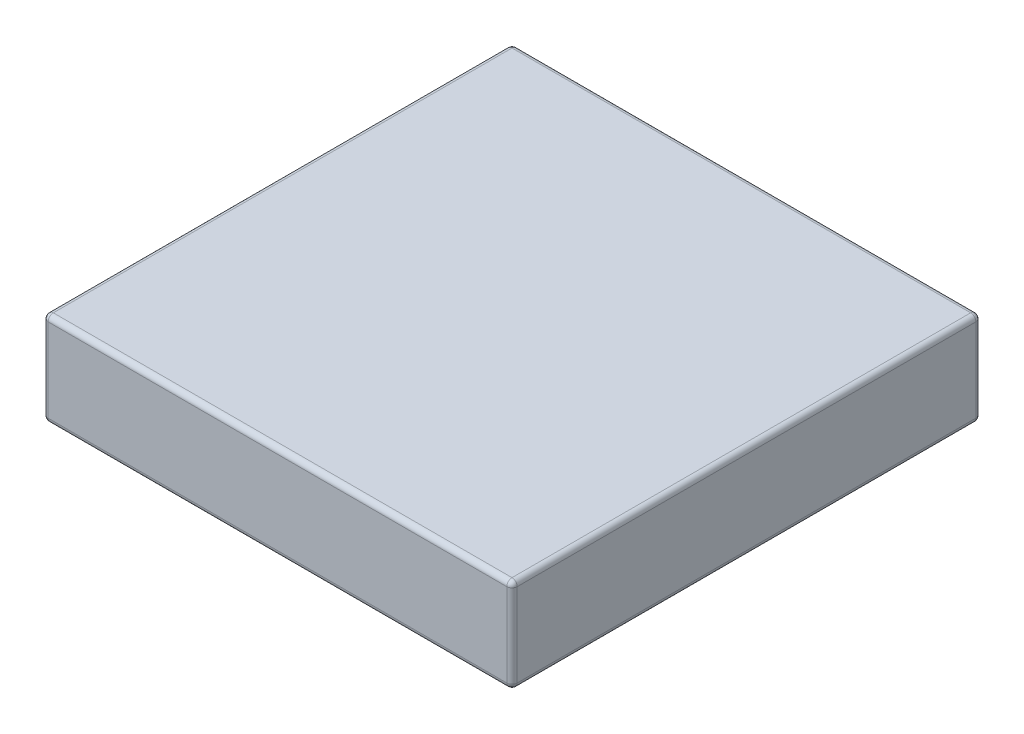
ISO-10303-21;
HEADER;
FILE_DESCRIPTION(('STEP AP214'),'2;1');
FILE_NAME('part.step','',(''),(''),'','','');
FILE_SCHEMA(('AUTOMOTIVE_DESIGN { 1 0 10303 214 1 1 1 1 }'));
ENDSEC;
DATA;
#1=APPLICATION_CONTEXT('core data for automotive mechanical design processes');
#2=APPLICATION_PROTOCOL_DEFINITION('international standard','automotive_design',2000,#1);
#3=PRODUCT_CONTEXT('',#1,'mechanical');
#4=PRODUCT('Part','Part','',(#3));
#5=PRODUCT_RELATED_PRODUCT_CATEGORY('part','',(#4));
#6=PRODUCT_DEFINITION_FORMATION('','',#4);
#7=PRODUCT_DEFINITION_CONTEXT('part definition',#1,'design');
#8=PRODUCT_DEFINITION('design','',#6,#7);
#9=PRODUCT_DEFINITION_SHAPE('','',#8);
#10=(LENGTH_UNIT() NAMED_UNIT(*) SI_UNIT(.MILLI.,.METRE.));
#11=(NAMED_UNIT(*) PLANE_ANGLE_UNIT() SI_UNIT($,.RADIAN.));
#12=(NAMED_UNIT(*) SI_UNIT($,.STERADIAN.) SOLID_ANGLE_UNIT());
#13=UNCERTAINTY_MEASURE_WITH_UNIT(LENGTH_MEASURE(1.E-05),#10,'distance_accuracy_value','');
#14=(GEOMETRIC_REPRESENTATION_CONTEXT(3) GLOBAL_UNCERTAINTY_ASSIGNED_CONTEXT((#13)) GLOBAL_UNIT_ASSIGNED_CONTEXT((#10,
#11,#12)) REPRESENTATION_CONTEXT('',''));
#15=CARTESIAN_POINT('',(0.,0.,0.));
#16=DIRECTION('',(0.,0.,1.));
#17=DIRECTION('',(1.,0.,0.));
#18=AXIS2_PLACEMENT_3D('',#15,#16,#17);
#19=CARTESIAN_POINT('',(0.,18.,0.));
#20=DIRECTION('',(1.,0.,0.));
#21=DIRECTION('',(0.,0.,-1.));
#22=AXIS2_PLACEMENT_3D('',#19,#20,#21);
#23=PLANE('',#22);
#24=DIRECTION('',(0.,-1.,0.));
#25=VECTOR('',#24,1.);
#26=CARTESIAN_POINT('',(0.,18.,-1.));
#27=LINE('',#26,#25);
#28=CARTESIAN_POINT('',(0.,1.,-1.));
#29=VERTEX_POINT('',#28);
#30=CARTESIAN_POINT('',(0.,17.,-1.));
#31=VERTEX_POINT('',#30);
#32=EDGE_CURVE('E135',#29,#31,#27,.F.);
#33=ORIENTED_EDGE('',*,*,#32,.T.);
#34=DIRECTION('',(0.,0.,1.));
#35=VECTOR('',#34,1.);
#36=CARTESIAN_POINT('',(0.,17.,0.));
#37=LINE('',#36,#35);
#38=CARTESIAN_POINT('',(0.,17.,-89.));
#39=VERTEX_POINT('',#38);
#40=EDGE_CURVE('E172',#31,#39,#37,.F.);
#41=ORIENTED_EDGE('',*,*,#40,.T.);
#42=DIRECTION('',(0.,-1.,0.));
#43=VECTOR('',#42,1.);
#44=CARTESIAN_POINT('',(0.,18.,-89.));
#45=LINE('',#44,#43);
#46=CARTESIAN_POINT('',(0.,1.,-89.));
#47=VERTEX_POINT('',#46);
#48=EDGE_CURVE('E169',#39,#47,#45,.T.);
#49=ORIENTED_EDGE('',*,*,#48,.T.);
#50=DIRECTION('',(0.,0.,1.));
#51=VECTOR('',#50,1.);
#52=CARTESIAN_POINT('',(0.,1.,0.));
#53=LINE('',#52,#51);
#54=EDGE_CURVE('E164',#47,#29,#53,.T.);
#55=ORIENTED_EDGE('',*,*,#54,.T.);
#56=EDGE_LOOP('',(#33,#41,#49,#55));
#57=FACE_BOUND('',#56,.T.);
#58=ADVANCED_FACE('F39',(#57),#23,.F.);
#59=CARTESIAN_POINT('',(0.,18.,0.));
#60=DIRECTION('',(0.,0.,-1.));
#61=DIRECTION('',(-1.,0.,0.));
#62=AXIS2_PLACEMENT_3D('',#59,#60,#61);
#63=PLANE('',#62);
#64=DIRECTION('',(0.,-1.,0.));
#65=VECTOR('',#64,1.);
#66=CARTESIAN_POINT('',(89.,18.,0.));
#67=LINE('',#66,#65);
#68=CARTESIAN_POINT('',(89.,1.,0.));
#69=VERTEX_POINT('',#68);
#70=CARTESIAN_POINT('',(89.,17.,0.));
#71=VERTEX_POINT('',#70);
#72=EDGE_CURVE('E157',#69,#71,#67,.F.);
#73=ORIENTED_EDGE('',*,*,#72,.T.);
#74=DIRECTION('',(1.,0.,0.));
#75=VECTOR('',#74,1.);
#76=CARTESIAN_POINT('',(0.,17.,0.));
#77=LINE('',#76,#75);
#78=CARTESIAN_POINT('',(1.,17.,0.));
#79=VERTEX_POINT('',#78);
#80=EDGE_CURVE('E161',#71,#79,#77,.F.);
#81=ORIENTED_EDGE('',*,*,#80,.T.);
#82=DIRECTION('',(0.,-1.,0.));
#83=VECTOR('',#82,1.);
#84=CARTESIAN_POINT('',(1.,18.,0.));
#85=LINE('',#84,#83);
#86=CARTESIAN_POINT('',(1.,1.,0.));
#87=VERTEX_POINT('',#86);
#88=EDGE_CURVE('E133',#79,#87,#85,.T.);
#89=ORIENTED_EDGE('',*,*,#88,.T.);
#90=DIRECTION('',(1.,0.,0.));
#91=VECTOR('',#90,1.);
#92=CARTESIAN_POINT('',(90.,1.,0.));
#93=LINE('',#92,#91);
#94=EDGE_CURVE('E151',#87,#69,#93,.T.);
#95=ORIENTED_EDGE('',*,*,#94,.T.);
#96=EDGE_LOOP('',(#73,#81,#89,#95));
#97=FACE_BOUND('',#96,.T.);
#98=ADVANCED_FACE('F159',(#97),#63,.F.);
#99=CARTESIAN_POINT('',(90.,18.,0.));
#100=DIRECTION('',(-1.,0.,0.));
#101=DIRECTION('',(0.,0.,1.));
#102=AXIS2_PLACEMENT_3D('',#99,#100,#101);
#103=PLANE('',#102);
#104=DIRECTION('',(0.,-1.,0.));
#105=VECTOR('',#104,1.);
#106=CARTESIAN_POINT('',(90.,18.,-89.));
#107=LINE('',#106,#105);
#108=CARTESIAN_POINT('',(90.,1.,-89.));
#109=VERTEX_POINT('',#108);
#110=CARTESIAN_POINT('',(90.,17.,-89.));
#111=VERTEX_POINT('',#110);
#112=EDGE_CURVE('E176',#109,#111,#107,.F.);
#113=ORIENTED_EDGE('',*,*,#112,.T.);
#114=DIRECTION('',(0.,0.,-1.));
#115=VECTOR('',#114,1.);
#116=CARTESIAN_POINT('',(90.,17.,0.));
#117=LINE('',#116,#115);
#118=CARTESIAN_POINT('',(90.,17.,-1.));
#119=VERTEX_POINT('',#118);
#120=EDGE_CURVE('E181',#111,#119,#117,.F.);
#121=ORIENTED_EDGE('',*,*,#120,.T.);
#122=DIRECTION('',(0.,-1.,0.));
#123=VECTOR('',#122,1.);
#124=CARTESIAN_POINT('',(90.,18.,-1.));
#125=LINE('',#124,#123);
#126=CARTESIAN_POINT('',(90.,1.,-1.));
#127=VERTEX_POINT('',#126);
#128=EDGE_CURVE('E178',#119,#127,#125,.T.);
#129=ORIENTED_EDGE('',*,*,#128,.T.);
#130=DIRECTION('',(0.,0.,-1.));
#131=VECTOR('',#130,1.);
#132=CARTESIAN_POINT('',(90.,1.,-90.));
#133=LINE('',#132,#131);
#134=EDGE_CURVE('E174',#127,#109,#133,.T.);
#135=ORIENTED_EDGE('',*,*,#134,.T.);
#136=EDGE_LOOP('',(#113,#121,#129,#135));
#137=FACE_BOUND('',#136,.T.);
#138=ADVANCED_FACE('F286',(#137),#103,.F.);
#139=CARTESIAN_POINT('',(0.,18.,-90.));
#140=DIRECTION('',(0.,0.,1.));
#141=DIRECTION('',(1.,0.,0.));
#142=AXIS2_PLACEMENT_3D('',#139,#140,#141);
#143=PLANE('',#142);
#144=DIRECTION('',(0.,-1.,0.));
#145=VECTOR('',#144,1.);
#146=CARTESIAN_POINT('',(1.,18.,-90.));
#147=LINE('',#146,#145);
#148=CARTESIAN_POINT('',(1.,1.,-90.));
#149=VERTEX_POINT('',#148);
#150=CARTESIAN_POINT('',(1.,17.,-90.));
#151=VERTEX_POINT('',#150);
#152=EDGE_CURVE('E185',#149,#151,#147,.F.);
#153=ORIENTED_EDGE('',*,*,#152,.T.);
#154=DIRECTION('',(-1.,0.,0.));
#155=VECTOR('',#154,1.);
#156=CARTESIAN_POINT('',(0.,17.,-90.));
#157=LINE('',#156,#155);
#158=CARTESIAN_POINT('',(89.,17.,-90.));
#159=VERTEX_POINT('',#158);
#160=EDGE_CURVE('E190',#151,#159,#157,.F.);
#161=ORIENTED_EDGE('',*,*,#160,.T.);
#162=DIRECTION('',(0.,-1.,0.));
#163=VECTOR('',#162,1.);
#164=CARTESIAN_POINT('',(89.,18.,-90.));
#165=LINE('',#164,#163);
#166=CARTESIAN_POINT('',(89.,1.,-90.));
#167=VERTEX_POINT('',#166);
#168=EDGE_CURVE('E187',#159,#167,#165,.T.);
#169=ORIENTED_EDGE('',*,*,#168,.T.);
#170=DIRECTION('',(-1.,0.,0.));
#171=VECTOR('',#170,1.);
#172=CARTESIAN_POINT('',(0.,1.,-90.));
#173=LINE('',#172,#171);
#174=EDGE_CURVE('E183',#167,#149,#173,.T.);
#175=ORIENTED_EDGE('',*,*,#174,.T.);
#176=EDGE_LOOP('',(#153,#161,#169,#175));
#177=FACE_BOUND('',#176,.T.);
#178=ADVANCED_FACE('F297',(#177),#143,.F.);
#179=CARTESIAN_POINT('',(0.,18.,0.));
#180=DIRECTION('',(0.,-1.,0.));
#181=DIRECTION('',(0.,0.,-1.));
#182=AXIS2_PLACEMENT_3D('',#179,#180,#181);
#183=PLANE('',#182);
#184=DIRECTION('',(0.,0.,-1.));
#185=VECTOR('',#184,1.);
#186=CARTESIAN_POINT('',(89.,18.,0.));
#187=LINE('',#186,#185);
#188=CARTESIAN_POINT('',(89.,18.,-1.));
#189=VERTEX_POINT('',#188);
#190=CARTESIAN_POINT('',(89.,18.,-89.));
#191=VERTEX_POINT('',#190);
#192=EDGE_CURVE('E196',#189,#191,#187,.T.);
#193=ORIENTED_EDGE('',*,*,#192,.T.);
#194=DIRECTION('',(-1.,0.,0.));
#195=VECTOR('',#194,1.);
#196=CARTESIAN_POINT('',(0.,18.,-89.));
#197=LINE('',#196,#195);
#198=CARTESIAN_POINT('',(1.,18.,-89.));
#199=VERTEX_POINT('',#198);
#200=EDGE_CURVE('E198',#191,#199,#197,.T.);
#201=ORIENTED_EDGE('',*,*,#200,.T.);
#202=DIRECTION('',(0.,0.,1.));
#203=VECTOR('',#202,1.);
#204=CARTESIAN_POINT('',(1.,18.,0.));
#205=LINE('',#204,#203);
#206=CARTESIAN_POINT('',(1.,18.,-1.));
#207=VERTEX_POINT('',#206);
#208=EDGE_CURVE('E192',#199,#207,#205,.T.);
#209=ORIENTED_EDGE('',*,*,#208,.T.);
#210=DIRECTION('',(1.,0.,0.));
#211=VECTOR('',#210,1.);
#212=CARTESIAN_POINT('',(0.,18.,-1.));
#213=LINE('',#212,#211);
#214=EDGE_CURVE('E194',#207,#189,#213,.T.);
#215=ORIENTED_EDGE('',*,*,#214,.T.);
#216=EDGE_LOOP('',(#193,#201,#209,#215));
#217=FACE_BOUND('',#216,.T.);
#218=ADVANCED_FACE('F278',(#217),#183,.F.);
#219=CARTESIAN_POINT('',(0.,0.,0.));
#220=DIRECTION('',(0.,-1.,0.));
#221=DIRECTION('',(0.,0.,-1.));
#222=AXIS2_PLACEMENT_3D('',#219,#220,#221);
#223=PLANE('',#222);
#224=DIRECTION('',(0.,0.,-1.));
#225=VECTOR('',#224,1.);
#226=CARTESIAN_POINT('',(89.,0.,0.));
#227=LINE('',#226,#225);
#228=CARTESIAN_POINT('',(89.,0.,-89.));
#229=VERTEX_POINT('',#228);
#230=CARTESIAN_POINT('',(89.,0.,-1.));
#231=VERTEX_POINT('',#230);
#232=EDGE_CURVE('E48',#229,#231,#227,.F.);
#233=ORIENTED_EDGE('',*,*,#232,.T.);
#234=DIRECTION('',(1.,0.,0.));
#235=VECTOR('',#234,1.);
#236=CARTESIAN_POINT('',(0.,0.,-1.));
#237=LINE('',#236,#235);
#238=CARTESIAN_POINT('',(1.,0.,-1.));
#239=VERTEX_POINT('',#238);
#240=EDGE_CURVE('E12',#231,#239,#237,.F.);
#241=ORIENTED_EDGE('',*,*,#240,.T.);
#242=DIRECTION('',(0.,0.,1.));
#243=VECTOR('',#242,1.);
#244=CARTESIAN_POINT('',(1.,0.,-90.));
#245=LINE('',#244,#243);
#246=CARTESIAN_POINT('',(1.,0.,-89.));
#247=VERTEX_POINT('',#246);
#248=EDGE_CURVE('E201',#239,#247,#245,.F.);
#249=ORIENTED_EDGE('',*,*,#248,.T.);
#250=DIRECTION('',(-1.,0.,0.));
#251=VECTOR('',#250,1.);
#252=CARTESIAN_POINT('',(90.,0.,-89.));
#253=LINE('',#252,#251);
#254=EDGE_CURVE('E59',#247,#229,#253,.F.);
#255=ORIENTED_EDGE('',*,*,#254,.T.);
#256=EDGE_LOOP('',(#233,#241,#249,#255));
#257=FACE_BOUND('',#256,.T.);
#258=ADVANCED_FACE('F399',(#257),#223,.T.);
#259=CARTESIAN_POINT('',(89.,18.,-89.));
#260=DIRECTION('',(0.,-1.,0.));
#261=DIRECTION('',(0.,0.,-1.));
#262=AXIS2_PLACEMENT_3D('',#259,#260,#261);
#263=CYLINDRICAL_SURFACE('',#262,1.);
#264=CARTESIAN_POINT('',(89.,17.,-89.));
#265=DIRECTION('',(0.,1.,0.));
#266=DIRECTION('',(0.,0.,1.));
#267=AXIS2_PLACEMENT_3D('',#264,#265,#266);
#268=CIRCLE('',#267,1.);
#269=EDGE_CURVE('E43',#111,#159,#268,.T.);
#270=ORIENTED_EDGE('',*,*,#269,.F.);
#271=ORIENTED_EDGE('',*,*,#112,.F.);
#272=CARTESIAN_POINT('',(89.,1.,-89.));
#273=DIRECTION('',(0.,-1.,0.));
#274=DIRECTION('',(0.,0.,-1.));
#275=AXIS2_PLACEMENT_3D('',#272,#273,#274);
#276=CIRCLE('',#275,1.);
#277=EDGE_CURVE('E255',#167,#109,#276,.T.);
#278=ORIENTED_EDGE('',*,*,#277,.F.);
#279=ORIENTED_EDGE('',*,*,#168,.F.);
#280=EDGE_LOOP('',(#270,#271,#278,#279));
#281=FACE_BOUND('',#280,.T.);
#282=ADVANCED_FACE('F41',(#281),#263,.T.);
#283=CARTESIAN_POINT('',(89.,17.,-89.));
#284=DIRECTION('',(0.,0.,-1.));
#285=DIRECTION('',(-1.,0.,0.));
#286=AXIS2_PLACEMENT_3D('',#283,#284,#285);
#287=SPHERICAL_SURFACE('',#286,1.);
#288=CARTESIAN_POINT('',(89.,17.,-89.));
#289=DIRECTION('',(0.,0.,-1.));
#290=DIRECTION('',(-1.,0.,0.));
#291=AXIS2_PLACEMENT_3D('',#288,#289,#290);
#292=CIRCLE('',#291,1.);
#293=EDGE_CURVE('E250',#111,#191,#292,.F.);
#294=ORIENTED_EDGE('',*,*,#293,.F.);
#295=ORIENTED_EDGE('',*,*,#269,.T.);
#296=CARTESIAN_POINT('',(89.,17.,-89.));
#297=DIRECTION('',(1.,0.,0.));
#298=DIRECTION('',(0.,0.,-1.));
#299=AXIS2_PLACEMENT_3D('',#296,#297,#298);
#300=CIRCLE('',#299,1.);
#301=EDGE_CURVE('E253',#191,#159,#300,.F.);
#302=ORIENTED_EDGE('',*,*,#301,.F.);
#303=EDGE_LOOP('',(#294,#295,#302));
#304=FACE_BOUND('',#303,.T.);
#305=ADVANCED_FACE('F266',(#304),#287,.T.);
#306=CARTESIAN_POINT('',(89.,1.,-89.));
#307=DIRECTION('',(1.,0.,0.));
#308=DIRECTION('',(0.,1.,0.));
#309=AXIS2_PLACEMENT_3D('',#306,#307,#308);
#310=SPHERICAL_SURFACE('',#309,1.);
#311=CARTESIAN_POINT('',(89.,1.,-89.));
#312=DIRECTION('',(1.,0.,0.));
#313=DIRECTION('',(0.,0.,-1.));
#314=AXIS2_PLACEMENT_3D('',#311,#312,#313);
#315=CIRCLE('',#314,1.);
#316=EDGE_CURVE('E245',#167,#229,#315,.F.);
#317=ORIENTED_EDGE('',*,*,#316,.F.);
#318=ORIENTED_EDGE('',*,*,#277,.T.);
#319=CARTESIAN_POINT('',(89.,1.,-89.));
#320=DIRECTION('',(0.,0.,-1.));
#321=DIRECTION('',(-1.,0.,0.));
#322=AXIS2_PLACEMENT_3D('',#319,#320,#321);
#323=CIRCLE('',#322,1.);
#324=EDGE_CURVE('E247',#229,#109,#323,.F.);
#325=ORIENTED_EDGE('',*,*,#324,.F.);
#326=EDGE_LOOP('',(#317,#318,#325));
#327=FACE_BOUND('',#326,.T.);
#328=ADVANCED_FACE('F424',(#327),#310,.T.);
#329=CARTESIAN_POINT('',(0.,17.,-89.));
#330=DIRECTION('',(-1.,0.,0.));
#331=DIRECTION('',(0.,0.,1.));
#332=AXIS2_PLACEMENT_3D('',#329,#330,#331);
#333=CYLINDRICAL_SURFACE('',#332,1.);
#334=ORIENTED_EDGE('',*,*,#301,.T.);
#335=ORIENTED_EDGE('',*,*,#160,.F.);
#336=CARTESIAN_POINT('',(1.,17.,-89.));
#337=DIRECTION('',(-1.,0.,0.));
#338=DIRECTION('',(0.,0.,1.));
#339=AXIS2_PLACEMENT_3D('',#336,#337,#338);
#340=CIRCLE('',#339,1.);
#341=EDGE_CURVE('E239',#199,#151,#340,.T.);
#342=ORIENTED_EDGE('',*,*,#341,.F.);
#343=ORIENTED_EDGE('',*,*,#200,.F.);
#344=EDGE_LOOP('',(#334,#335,#342,#343));
#345=FACE_BOUND('',#344,.T.);
#346=ADVANCED_FACE('F274',(#345),#333,.T.);
#347=CARTESIAN_POINT('',(89.,17.,0.));
#348=DIRECTION('',(0.,0.,-1.));
#349=DIRECTION('',(-1.,0.,0.));
#350=AXIS2_PLACEMENT_3D('',#347,#348,#349);
#351=CYLINDRICAL_SURFACE('',#350,1.);
#352=ORIENTED_EDGE('',*,*,#293,.T.);
#353=ORIENTED_EDGE('',*,*,#192,.F.);
#354=CARTESIAN_POINT('',(89.,17.,-1.));
#355=DIRECTION('',(0.,0.,1.));
#356=DIRECTION('',(1.,0.,0.));
#357=AXIS2_PLACEMENT_3D('',#354,#355,#356);
#358=CIRCLE('',#357,1.);
#359=EDGE_CURVE('E236',#119,#189,#358,.T.);
#360=ORIENTED_EDGE('',*,*,#359,.F.);
#361=ORIENTED_EDGE('',*,*,#120,.F.);
#362=EDGE_LOOP('',(#352,#353,#360,#361));
#363=FACE_BOUND('',#362,.T.);
#364=ADVANCED_FACE('F283',(#363),#351,.T.);
#365=CARTESIAN_POINT('',(89.,18.,-1.));
#366=DIRECTION('',(0.,-1.,0.));
#367=DIRECTION('',(0.,0.,-1.));
#368=AXIS2_PLACEMENT_3D('',#365,#366,#367);
#369=CYLINDRICAL_SURFACE('',#368,1.);
#370=CARTESIAN_POINT('',(89.,1.,-1.));
#371=DIRECTION('',(0.,-1.,0.));
#372=DIRECTION('',(0.,0.,-1.));
#373=AXIS2_PLACEMENT_3D('',#370,#371,#372);
#374=CIRCLE('',#373,1.);
#375=EDGE_CURVE('E230',#127,#69,#374,.T.);
#376=ORIENTED_EDGE('',*,*,#375,.F.);
#377=ORIENTED_EDGE('',*,*,#128,.F.);
#378=CARTESIAN_POINT('',(89.,17.,-1.));
#379=DIRECTION('',(0.,1.,0.));
#380=DIRECTION('',(0.,0.,1.));
#381=AXIS2_PLACEMENT_3D('',#378,#379,#380);
#382=CIRCLE('',#381,1.);
#383=EDGE_CURVE('E233',#71,#119,#382,.T.);
#384=ORIENTED_EDGE('',*,*,#383,.F.);
#385=ORIENTED_EDGE('',*,*,#72,.F.);
#386=EDGE_LOOP('',(#376,#377,#384,#385));
#387=FACE_BOUND('',#386,.T.);
#388=ADVANCED_FACE('F290',(#387),#369,.T.);
#389=CARTESIAN_POINT('',(89.,1.,0.));
#390=DIRECTION('',(0.,0.,1.));
#391=DIRECTION('',(1.,0.,0.));
#392=AXIS2_PLACEMENT_3D('',#389,#390,#391);
#393=CYLINDRICAL_SURFACE('',#392,1.);
#394=ORIENTED_EDGE('',*,*,#324,.T.);
#395=ORIENTED_EDGE('',*,*,#134,.F.);
#396=CARTESIAN_POINT('',(89.,1.,-1.));
#397=DIRECTION('',(0.,0.,1.));
#398=DIRECTION('',(1.,0.,0.));
#399=AXIS2_PLACEMENT_3D('',#396,#397,#398);
#400=CIRCLE('',#399,1.);
#401=EDGE_CURVE('E228',#231,#127,#400,.T.);
#402=ORIENTED_EDGE('',*,*,#401,.F.);
#403=ORIENTED_EDGE('',*,*,#232,.F.);
#404=EDGE_LOOP('',(#394,#395,#402,#403));
#405=FACE_BOUND('',#404,.T.);
#406=ADVANCED_FACE('F295',(#405),#393,.T.);
#407=CARTESIAN_POINT('',(0.,1.,-89.));
#408=DIRECTION('',(1.,0.,0.));
#409=DIRECTION('',(0.,0.,-1.));
#410=AXIS2_PLACEMENT_3D('',#407,#408,#409);
#411=CYLINDRICAL_SURFACE('',#410,1.);
#412=ORIENTED_EDGE('',*,*,#316,.T.);
#413=ORIENTED_EDGE('',*,*,#254,.F.);
#414=CARTESIAN_POINT('',(1.,1.,-89.));
#415=DIRECTION('',(-1.,0.,0.));
#416=DIRECTION('',(0.,0.,1.));
#417=AXIS2_PLACEMENT_3D('',#414,#415,#416);
#418=CIRCLE('',#417,1.);
#419=EDGE_CURVE('E225',#149,#247,#418,.T.);
#420=ORIENTED_EDGE('',*,*,#419,.F.);
#421=ORIENTED_EDGE('',*,*,#174,.F.);
#422=EDGE_LOOP('',(#412,#413,#420,#421));
#423=FACE_BOUND('',#422,.T.);
#424=ADVANCED_FACE('F306',(#423),#411,.T.);
#425=CARTESIAN_POINT('',(1.,18.,-89.));
#426=DIRECTION('',(0.,-1.,0.));
#427=DIRECTION('',(0.,0.,-1.));
#428=AXIS2_PLACEMENT_3D('',#425,#426,#427);
#429=CYLINDRICAL_SURFACE('',#428,1.);
#430=CARTESIAN_POINT('',(1.,17.,-89.));
#431=DIRECTION('',(0.,1.,0.));
#432=DIRECTION('',(0.,0.,1.));
#433=AXIS2_PLACEMENT_3D('',#430,#431,#432);
#434=CIRCLE('',#433,1.);
#435=EDGE_CURVE('E242',#151,#39,#434,.T.);
#436=ORIENTED_EDGE('',*,*,#435,.F.);
#437=ORIENTED_EDGE('',*,*,#152,.F.);
#438=CARTESIAN_POINT('',(1.,1.,-89.));
#439=DIRECTION('',(0.,-1.,0.));
#440=DIRECTION('',(0.,0.,-1.));
#441=AXIS2_PLACEMENT_3D('',#438,#439,#440);
#442=CIRCLE('',#441,1.);
#443=EDGE_CURVE('E222',#47,#149,#442,.T.);
#444=ORIENTED_EDGE('',*,*,#443,.F.);
#445=ORIENTED_EDGE('',*,*,#48,.F.);
#446=EDGE_LOOP('',(#436,#437,#444,#445));
#447=FACE_BOUND('',#446,.T.);
#448=ADVANCED_FACE('F302',(#447),#429,.T.);
#449=CARTESIAN_POINT('',(1.,17.,-89.));
#450=DIRECTION('',(0.,0.,-1.));
#451=DIRECTION('',(-1.,0.,0.));
#452=AXIS2_PLACEMENT_3D('',#449,#450,#451);
#453=SPHERICAL_SURFACE('',#452,1.);
#454=ORIENTED_EDGE('',*,*,#341,.T.);
#455=ORIENTED_EDGE('',*,*,#435,.T.);
#456=CARTESIAN_POINT('',(1.,17.,-89.));
#457=DIRECTION('',(0.,0.,-1.));
#458=DIRECTION('',(-1.,0.,0.));
#459=AXIS2_PLACEMENT_3D('',#456,#457,#458);
#460=CIRCLE('',#459,1.);
#461=EDGE_CURVE('E219',#199,#39,#460,.F.);
#462=ORIENTED_EDGE('',*,*,#461,.F.);
#463=EDGE_LOOP('',(#454,#455,#462));
#464=FACE_BOUND('',#463,.T.);
#465=ADVANCED_FACE('F316',(#464),#453,.T.);
#466=CARTESIAN_POINT('',(89.,17.,-1.));
#467=DIRECTION('',(1.,0.,0.));
#468=DIRECTION('',(0.,0.,-1.));
#469=AXIS2_PLACEMENT_3D('',#466,#467,#468);
#470=SPHERICAL_SURFACE('',#469,1.);
#471=ORIENTED_EDGE('',*,*,#383,.T.);
#472=ORIENTED_EDGE('',*,*,#359,.T.);
#473=CARTESIAN_POINT('',(89.,17.,-1.));
#474=DIRECTION('',(1.,0.,0.));
#475=DIRECTION('',(0.,0.,-1.));
#476=AXIS2_PLACEMENT_3D('',#473,#474,#475);
#477=CIRCLE('',#476,1.);
#478=EDGE_CURVE('E216',#71,#189,#477,.F.);
#479=ORIENTED_EDGE('',*,*,#478,.F.);
#480=EDGE_LOOP('',(#471,#472,#479));
#481=FACE_BOUND('',#480,.T.);
#482=ADVANCED_FACE('F326',(#481),#470,.T.);
#483=CARTESIAN_POINT('',(89.,1.,-1.));
#484=DIRECTION('',(1.,0.,0.));
#485=DIRECTION('',(0.,1.,0.));
#486=AXIS2_PLACEMENT_3D('',#483,#484,#485);
#487=SPHERICAL_SURFACE('',#486,1.);
#488=ORIENTED_EDGE('',*,*,#401,.T.);
#489=ORIENTED_EDGE('',*,*,#375,.T.);
#490=CARTESIAN_POINT('',(89.,1.,-1.));
#491=DIRECTION('',(1.,0.,0.));
#492=DIRECTION('',(0.,0.,-1.));
#493=AXIS2_PLACEMENT_3D('',#490,#491,#492);
#494=CIRCLE('',#493,1.);
#495=EDGE_CURVE('E154',#231,#69,#494,.F.);
#496=ORIENTED_EDGE('',*,*,#495,.F.);
#497=EDGE_LOOP('',(#488,#489,#496));
#498=FACE_BOUND('',#497,.T.);
#499=ADVANCED_FACE('F328',(#498),#487,.T.);
#500=CARTESIAN_POINT('',(1.,1.,-89.));
#501=DIRECTION('',(0.,0.,-1.));
#502=DIRECTION('',(0.,1.,0.));
#503=AXIS2_PLACEMENT_3D('',#500,#501,#502);
#504=SPHERICAL_SURFACE('',#503,1.);
#505=ORIENTED_EDGE('',*,*,#443,.T.);
#506=ORIENTED_EDGE('',*,*,#419,.T.);
#507=CARTESIAN_POINT('',(1.,1.,-89.));
#508=DIRECTION('',(0.,0.,-1.));
#509=DIRECTION('',(-1.,0.,0.));
#510=AXIS2_PLACEMENT_3D('',#507,#508,#509);
#511=CIRCLE('',#510,1.);
#512=EDGE_CURVE('E212',#47,#247,#511,.F.);
#513=ORIENTED_EDGE('',*,*,#512,.F.);
#514=EDGE_LOOP('',(#505,#506,#513));
#515=FACE_BOUND('',#514,.T.);
#516=ADVANCED_FACE('F308',(#515),#504,.T.);
#517=CARTESIAN_POINT('',(1.,17.,0.));
#518=DIRECTION('',(0.,0.,1.));
#519=DIRECTION('',(1.,0.,0.));
#520=AXIS2_PLACEMENT_3D('',#517,#518,#519);
#521=CYLINDRICAL_SURFACE('',#520,1.);
#522=ORIENTED_EDGE('',*,*,#461,.T.);
#523=ORIENTED_EDGE('',*,*,#40,.F.);
#524=CARTESIAN_POINT('',(1.,17.,-1.));
#525=DIRECTION('',(0.,0.,1.));
#526=DIRECTION('',(1.,0.,0.));
#527=AXIS2_PLACEMENT_3D('',#524,#525,#526);
#528=CIRCLE('',#527,1.);
#529=EDGE_CURVE('E209',#207,#31,#528,.T.);
#530=ORIENTED_EDGE('',*,*,#529,.F.);
#531=ORIENTED_EDGE('',*,*,#208,.F.);
#532=EDGE_LOOP('',(#522,#523,#530,#531));
#533=FACE_BOUND('',#532,.T.);
#534=ADVANCED_FACE('F318',(#533),#521,.T.);
#535=CARTESIAN_POINT('',(0.,17.,-1.));
#536=DIRECTION('',(1.,0.,0.));
#537=DIRECTION('',(0.,0.,-1.));
#538=AXIS2_PLACEMENT_3D('',#535,#536,#537);
#539=CYLINDRICAL_SURFACE('',#538,1.);
#540=ORIENTED_EDGE('',*,*,#478,.T.);
#541=ORIENTED_EDGE('',*,*,#214,.F.);
#542=CARTESIAN_POINT('',(1.,17.,-1.));
#543=DIRECTION('',(-1.,0.,0.));
#544=DIRECTION('',(0.,0.,1.));
#545=AXIS2_PLACEMENT_3D('',#542,#543,#544);
#546=CIRCLE('',#545,1.);
#547=EDGE_CURVE('E148',#79,#207,#546,.T.);
#548=ORIENTED_EDGE('',*,*,#547,.F.);
#549=ORIENTED_EDGE('',*,*,#80,.F.);
#550=EDGE_LOOP('',(#540,#541,#548,#549));
#551=FACE_BOUND('',#550,.T.);
#552=ADVANCED_FACE('F324',(#551),#539,.T.);
#553=CARTESIAN_POINT('',(0.,1.,-1.));
#554=DIRECTION('',(-1.,0.,0.));
#555=DIRECTION('',(0.,0.,1.));
#556=AXIS2_PLACEMENT_3D('',#553,#554,#555);
#557=CYLINDRICAL_SURFACE('',#556,1.);
#558=ORIENTED_EDGE('',*,*,#495,.T.);
#559=ORIENTED_EDGE('',*,*,#94,.F.);
#560=CARTESIAN_POINT('',(1.,1.,-1.));
#561=DIRECTION('',(-1.,0.,0.));
#562=DIRECTION('',(0.,0.,1.));
#563=AXIS2_PLACEMENT_3D('',#560,#561,#562);
#564=CIRCLE('',#563,1.);
#565=EDGE_CURVE('E140',#239,#87,#564,.T.);
#566=ORIENTED_EDGE('',*,*,#565,.F.);
#567=ORIENTED_EDGE('',*,*,#240,.F.);
#568=EDGE_LOOP('',(#558,#559,#566,#567));
#569=FACE_BOUND('',#568,.T.);
#570=ADVANCED_FACE('F152',(#569),#557,.T.);
#571=CARTESIAN_POINT('',(1.,1.,0.));
#572=DIRECTION('',(0.,0.,-1.));
#573=DIRECTION('',(-1.,0.,0.));
#574=AXIS2_PLACEMENT_3D('',#571,#572,#573);
#575=CYLINDRICAL_SURFACE('',#574,1.);
#576=ORIENTED_EDGE('',*,*,#512,.T.);
#577=ORIENTED_EDGE('',*,*,#248,.F.);
#578=CARTESIAN_POINT('',(1.,1.,-1.));
#579=DIRECTION('',(0.,0.,1.));
#580=DIRECTION('',(1.,0.,0.));
#581=AXIS2_PLACEMENT_3D('',#578,#579,#580);
#582=CIRCLE('',#581,1.);
#583=EDGE_CURVE('E144',#29,#239,#582,.T.);
#584=ORIENTED_EDGE('',*,*,#583,.F.);
#585=ORIENTED_EDGE('',*,*,#54,.F.);
#586=EDGE_LOOP('',(#576,#577,#584,#585));
#587=FACE_BOUND('',#586,.T.);
#588=ADVANCED_FACE('F311',(#587),#575,.T.);
#589=CARTESIAN_POINT('',(1.,17.,-1.));
#590=DIRECTION('',(0.,1.,0.));
#591=DIRECTION('',(0.,0.,1.));
#592=AXIS2_PLACEMENT_3D('',#589,#590,#591);
#593=SPHERICAL_SURFACE('',#592,1.);
#594=ORIENTED_EDGE('',*,*,#547,.T.);
#595=ORIENTED_EDGE('',*,*,#529,.T.);
#596=CARTESIAN_POINT('',(1.,17.,-1.));
#597=DIRECTION('',(0.,1.,0.));
#598=DIRECTION('',(0.,0.,1.));
#599=AXIS2_PLACEMENT_3D('',#596,#597,#598);
#600=CIRCLE('',#599,1.);
#601=EDGE_CURVE('E137',#79,#31,#600,.F.);
#602=ORIENTED_EDGE('',*,*,#601,.F.);
#603=EDGE_LOOP('',(#594,#595,#602));
#604=FACE_BOUND('',#603,.T.);
#605=ADVANCED_FACE('F322',(#604),#593,.T.);
#606=CARTESIAN_POINT('',(1.,1.,-1.));
#607=DIRECTION('',(0.,-1.,0.));
#608=DIRECTION('',(0.,0.,-1.));
#609=AXIS2_PLACEMENT_3D('',#606,#607,#608);
#610=SPHERICAL_SURFACE('',#609,1.);
#611=ORIENTED_EDGE('',*,*,#583,.T.);
#612=ORIENTED_EDGE('',*,*,#565,.T.);
#613=CARTESIAN_POINT('',(1.,1.,-1.));
#614=DIRECTION('',(0.,-1.,0.));
#615=DIRECTION('',(0.,0.,-1.));
#616=AXIS2_PLACEMENT_3D('',#613,#614,#615);
#617=CIRCLE('',#616,1.);
#618=EDGE_CURVE('E129',#29,#87,#617,.F.);
#619=ORIENTED_EDGE('',*,*,#618,.F.);
#620=EDGE_LOOP('',(#611,#612,#619));
#621=FACE_BOUND('',#620,.T.);
#622=ADVANCED_FACE('F142',(#621),#610,.T.);
#623=CARTESIAN_POINT('',(1.,18.,-1.));
#624=DIRECTION('',(0.,-1.,0.));
#625=DIRECTION('',(0.,0.,-1.));
#626=AXIS2_PLACEMENT_3D('',#623,#624,#625);
#627=CYLINDRICAL_SURFACE('',#626,1.);
#628=ORIENTED_EDGE('',*,*,#601,.T.);
#629=ORIENTED_EDGE('',*,*,#32,.F.);
#630=ORIENTED_EDGE('',*,*,#618,.T.);
#631=ORIENTED_EDGE('',*,*,#88,.F.);
#632=EDGE_LOOP('',(#628,#629,#630,#631));
#633=FACE_BOUND('',#632,.T.);
#634=ADVANCED_FACE('F131',(#633),#627,.T.);
#635=CLOSED_SHELL('',(#58,#98,#138,#178,#218,#258,#282,#305,#328,#346,#364,#388,#406,#424,#448,
#465,#482,#499,#516,#534,#552,#570,#588,#605,#622,#634));
#636=MANIFOLD_SOLID_BREP('B2',#635);
#637=ADVANCED_BREP_SHAPE_REPRESENTATION('',(#18,#636),#14);
#638=SHAPE_DEFINITION_REPRESENTATION(#9,#637);
ENDSEC;
END-ISO-10303-21;
